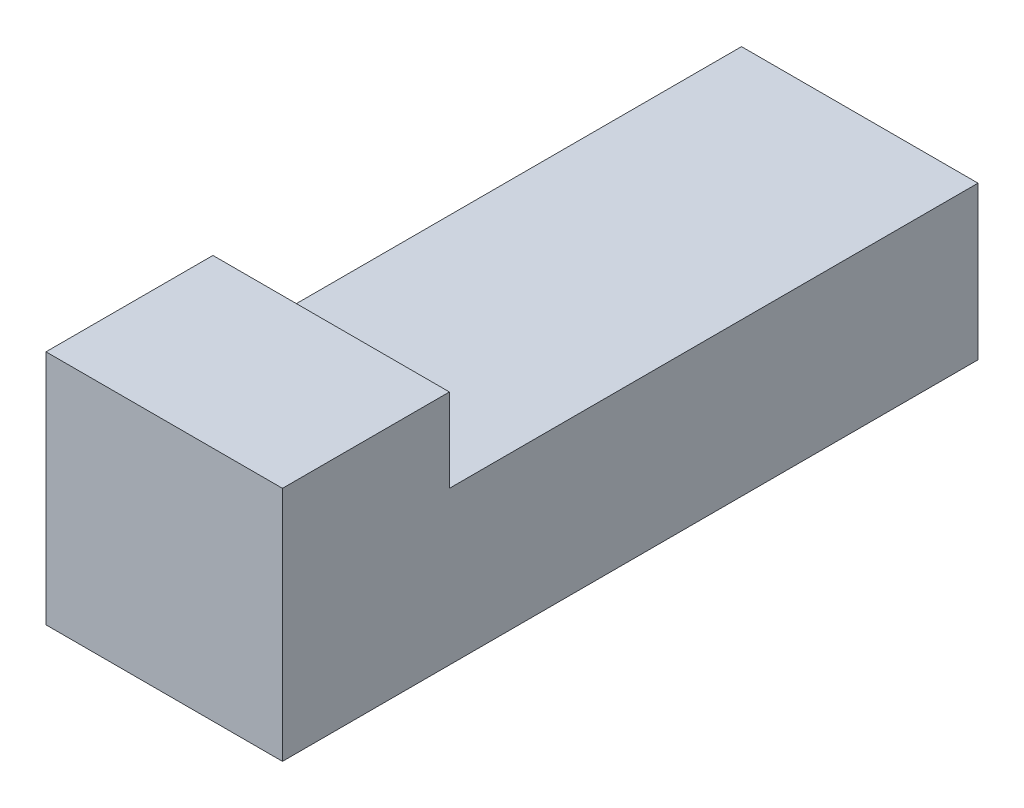
ISO-10303-21;
HEADER;
FILE_DESCRIPTION(('STEP AP214'),'2;1');
FILE_NAME('part.step','',(''),(''),'','','');
FILE_SCHEMA(('AUTOMOTIVE_DESIGN { 1 0 10303 214 1 1 1 1 }'));
ENDSEC;
DATA;
#1=APPLICATION_CONTEXT('core data for automotive mechanical design processes');
#2=APPLICATION_PROTOCOL_DEFINITION('international standard','automotive_design',2000,#1);
#3=PRODUCT_CONTEXT('',#1,'mechanical');
#4=PRODUCT('Part','Part','',(#3));
#5=PRODUCT_RELATED_PRODUCT_CATEGORY('part','',(#4));
#6=PRODUCT_DEFINITION_FORMATION('','',#4);
#7=PRODUCT_DEFINITION_CONTEXT('part definition',#1,'design');
#8=PRODUCT_DEFINITION('design','',#6,#7);
#9=PRODUCT_DEFINITION_SHAPE('','',#8);
#10=(LENGTH_UNIT() NAMED_UNIT(*) SI_UNIT(.MILLI.,.METRE.));
#11=(NAMED_UNIT(*) PLANE_ANGLE_UNIT() SI_UNIT($,.RADIAN.));
#12=(NAMED_UNIT(*) SI_UNIT($,.STERADIAN.) SOLID_ANGLE_UNIT());
#13=UNCERTAINTY_MEASURE_WITH_UNIT(LENGTH_MEASURE(1.E-05),#10,'distance_accuracy_value','');
#14=(GEOMETRIC_REPRESENTATION_CONTEXT(3) GLOBAL_UNCERTAINTY_ASSIGNED_CONTEXT((#13)) GLOBAL_UNIT_ASSIGNED_CONTEXT((#10,
#11,#12)) REPRESENTATION_CONTEXT('',''));
#15=CARTESIAN_POINT('',(0.,0.,0.));
#16=DIRECTION('',(0.,0.,1.));
#17=DIRECTION('',(1.,0.,0.));
#18=AXIS2_PLACEMENT_3D('',#15,#16,#17);
#19=CARTESIAN_POINT('',(-34.2810417125712,1.38297930543054,12.7));
#20=DIRECTION('',(1.,0.,0.));
#21=DIRECTION('',(0.,0.,-1.));
#22=AXIS2_PLACEMENT_3D('',#19,#20,#21);
#23=PLANE('',#22);
#24=DIRECTION('',(0.,-1.,0.));
#25=VECTOR('',#24,1.);
#26=CARTESIAN_POINT('',(-34.2810417125712,1.38297930543054,9.652));
#27=LINE('',#26,#25);
#28=CARTESIAN_POINT('',(-34.2810417125712,1.38297930543054,9.652));
#29=VERTEX_POINT('',#28);
#30=CARTESIAN_POINT('',(-34.2810417125712,-0.141020694569455,9.652));
#31=VERTEX_POINT('',#30);
#32=EDGE_CURVE('E102',#29,#31,#27,.T.);
#33=ORIENTED_EDGE('',*,*,#32,.T.);
#34=DIRECTION('',(0.,0.,1.));
#35=VECTOR('',#34,1.);
#36=CARTESIAN_POINT('',(-34.2810417125712,-0.141020694569455,-3.048));
#37=LINE('',#36,#35);
#38=CARTESIAN_POINT('',(-34.2810417125712,-0.141020694569455,0.));
#39=VERTEX_POINT('',#38);
#40=EDGE_CURVE('E91',#39,#31,#37,.T.);
#41=ORIENTED_EDGE('',*,*,#40,.F.);
#42=DIRECTION('',(0.,-1.,0.));
#43=VECTOR('',#42,1.);
#44=CARTESIAN_POINT('',(-34.2810417125712,1.38297930543054,0.));
#45=LINE('',#44,#43);
#46=CARTESIAN_POINT('',(-34.2810417125712,-2.93502069456945,0.));
#47=VERTEX_POINT('',#46);
#48=EDGE_CURVE('E114',#39,#47,#45,.T.);
#49=ORIENTED_EDGE('',*,*,#48,.T.);
#50=DIRECTION('',(0.,0.,-1.));
#51=VECTOR('',#50,1.);
#52=CARTESIAN_POINT('',(-34.2810417125712,-2.93502069456945,12.7));
#53=LINE('',#52,#51);
#54=CARTESIAN_POINT('',(-34.2810417125712,-2.93502069456945,12.7));
#55=VERTEX_POINT('',#54);
#56=EDGE_CURVE('E40',#55,#47,#53,.T.);
#57=ORIENTED_EDGE('',*,*,#56,.F.);
#58=DIRECTION('',(0.,-1.,0.));
#59=VECTOR('',#58,1.);
#60=CARTESIAN_POINT('',(-34.2810417125712,1.38297930543054,12.7));
#61=LINE('',#60,#59);
#62=CARTESIAN_POINT('',(-34.2810417125712,1.38297930543054,12.7));
#63=VERTEX_POINT('',#62);
#64=EDGE_CURVE('E116',#63,#55,#61,.T.);
#65=ORIENTED_EDGE('',*,*,#64,.F.);
#66=DIRECTION('',(0.,0.,-1.));
#67=VECTOR('',#66,1.);
#68=CARTESIAN_POINT('',(-34.2810417125712,1.38297930543054,12.7));
#69=LINE('',#68,#67);
#70=EDGE_CURVE('E109',#63,#29,#69,.T.);
#71=ORIENTED_EDGE('',*,*,#70,.T.);
#72=EDGE_LOOP('',(#33,#41,#49,#57,#65,#71));
#73=FACE_BOUND('',#72,.T.);
#74=ADVANCED_FACE('F33',(#73),#23,.F.);
#75=CARTESIAN_POINT('',(-34.2810417125712,-2.93502069456945,12.7));
#76=DIRECTION('',(0.,1.,0.));
#77=DIRECTION('',(0.,0.,1.));
#78=AXIS2_PLACEMENT_3D('',#75,#76,#77);
#79=PLANE('',#78);
#80=DIRECTION('',(1.,0.,0.));
#81=VECTOR('',#80,1.);
#82=CARTESIAN_POINT('',(-34.2810417125712,-2.93502069456945,0.));
#83=LINE('',#82,#81);
#84=CARTESIAN_POINT('',(-29.9630417125712,-2.93502069456945,0.));
#85=VERTEX_POINT('',#84);
#86=EDGE_CURVE('E71',#47,#85,#83,.T.);
#87=ORIENTED_EDGE('',*,*,#86,.T.);
#88=DIRECTION('',(0.,0.,-1.));
#89=VECTOR('',#88,1.);
#90=CARTESIAN_POINT('',(-29.9630417125712,-2.93502069456945,12.7));
#91=LINE('',#90,#89);
#92=CARTESIAN_POINT('',(-29.9630417125712,-2.93502069456945,12.7));
#93=VERTEX_POINT('',#92);
#94=EDGE_CURVE('E131',#93,#85,#91,.T.);
#95=ORIENTED_EDGE('',*,*,#94,.F.);
#96=DIRECTION('',(1.,0.,0.));
#97=VECTOR('',#96,1.);
#98=CARTESIAN_POINT('',(-34.2810417125712,-2.93502069456945,12.7));
#99=LINE('',#98,#97);
#100=EDGE_CURVE('E76',#55,#93,#99,.T.);
#101=ORIENTED_EDGE('',*,*,#100,.F.);
#102=ORIENTED_EDGE('',*,*,#56,.T.);
#103=EDGE_LOOP('',(#87,#95,#101,#102));
#104=FACE_BOUND('',#103,.T.);
#105=ADVANCED_FACE('F133',(#104),#79,.F.);
#106=CARTESIAN_POINT('',(-29.9630417125712,1.38297930543054,12.7));
#107=DIRECTION('',(-1.,0.,0.));
#108=DIRECTION('',(0.,0.,1.));
#109=AXIS2_PLACEMENT_3D('',#106,#107,#108);
#110=PLANE('',#109);
#111=DIRECTION('',(0.,1.,0.));
#112=VECTOR('',#111,1.);
#113=CARTESIAN_POINT('',(-29.9630417125712,1.38297930543054,0.));
#114=LINE('',#113,#112);
#115=CARTESIAN_POINT('',(-29.9630417125712,-0.141020694569455,0.));
#116=VERTEX_POINT('',#115);
#117=EDGE_CURVE('E118',#85,#116,#114,.T.);
#118=ORIENTED_EDGE('',*,*,#117,.T.);
#119=DIRECTION('',(0.,0.,1.));
#120=VECTOR('',#119,1.);
#121=CARTESIAN_POINT('',(-29.9630417125712,-0.141020694569455,-3.048));
#122=LINE('',#121,#120);
#123=CARTESIAN_POINT('',(-29.9630417125712,-0.141020694569455,9.652));
#124=VERTEX_POINT('',#123);
#125=EDGE_CURVE('E47',#116,#124,#122,.T.);
#126=ORIENTED_EDGE('',*,*,#125,.T.);
#127=DIRECTION('',(0.,1.,0.));
#128=VECTOR('',#127,1.);
#129=CARTESIAN_POINT('',(-29.9630417125712,1.38297930543054,9.652));
#130=LINE('',#129,#128);
#131=CARTESIAN_POINT('',(-29.9630417125712,1.38297930543054,9.652));
#132=VERTEX_POINT('',#131);
#133=EDGE_CURVE('E105',#124,#132,#130,.T.);
#134=ORIENTED_EDGE('',*,*,#133,.T.);
#135=DIRECTION('',(0.,0.,-1.));
#136=VECTOR('',#135,1.);
#137=CARTESIAN_POINT('',(-29.9630417125712,1.38297930543054,12.7));
#138=LINE('',#137,#136);
#139=CARTESIAN_POINT('',(-29.9630417125712,1.38297930543054,12.7));
#140=VERTEX_POINT('',#139);
#141=EDGE_CURVE('E128',#140,#132,#138,.T.);
#142=ORIENTED_EDGE('',*,*,#141,.F.);
#143=DIRECTION('',(0.,1.,0.));
#144=VECTOR('',#143,1.);
#145=CARTESIAN_POINT('',(-29.9630417125712,1.38297930543054,12.7));
#146=LINE('',#145,#144);
#147=EDGE_CURVE('E120',#93,#140,#146,.T.);
#148=ORIENTED_EDGE('',*,*,#147,.F.);
#149=ORIENTED_EDGE('',*,*,#94,.T.);
#150=EDGE_LOOP('',(#118,#126,#134,#142,#148,#149));
#151=FACE_BOUND('',#150,.T.);
#152=ADVANCED_FACE('F138',(#151),#110,.F.);
#153=CARTESIAN_POINT('',(-34.2810417125712,1.38297930543054,12.7));
#154=DIRECTION('',(0.,-1.,0.));
#155=DIRECTION('',(0.,0.,-1.));
#156=AXIS2_PLACEMENT_3D('',#153,#154,#155);
#157=PLANE('',#156);
#158=ORIENTED_EDGE('',*,*,#141,.T.);
#159=DIRECTION('',(-1.,0.,0.));
#160=VECTOR('',#159,1.);
#161=CARTESIAN_POINT('',(-34.2810417125712,1.38297930543054,9.652));
#162=LINE('',#161,#160);
#163=EDGE_CURVE('E98',#132,#29,#162,.T.);
#164=ORIENTED_EDGE('',*,*,#163,.T.);
#165=ORIENTED_EDGE('',*,*,#70,.F.);
#166=DIRECTION('',(-1.,0.,0.));
#167=VECTOR('',#166,1.);
#168=CARTESIAN_POINT('',(-34.2810417125712,1.38297930543054,12.7));
#169=LINE('',#168,#167);
#170=EDGE_CURVE('E55',#140,#63,#169,.T.);
#171=ORIENTED_EDGE('',*,*,#170,.F.);
#172=EDGE_LOOP('',(#158,#164,#165,#171));
#173=FACE_BOUND('',#172,.T.);
#174=ADVANCED_FACE('F143',(#173),#157,.F.);
#175=CARTESIAN_POINT('',(0.,0.,12.7));
#176=DIRECTION('',(0.,0.,1.));
#177=DIRECTION('',(1.,0.,0.));
#178=AXIS2_PLACEMENT_3D('',#175,#176,#177);
#179=PLANE('',#178);
#180=ORIENTED_EDGE('',*,*,#64,.T.);
#181=ORIENTED_EDGE('',*,*,#100,.T.);
#182=ORIENTED_EDGE('',*,*,#147,.T.);
#183=ORIENTED_EDGE('',*,*,#170,.T.);
#184=EDGE_LOOP('',(#180,#181,#182,#183));
#185=FACE_BOUND('',#184,.T.);
#186=ADVANCED_FACE('F141',(#185),#179,.T.);
#187=CARTESIAN_POINT('',(0.,0.,0.));
#188=DIRECTION('',(0.,0.,1.));
#189=DIRECTION('',(1.,0.,0.));
#190=AXIS2_PLACEMENT_3D('',#187,#188,#189);
#191=PLANE('',#190);
#192=ORIENTED_EDGE('',*,*,#48,.F.);
#193=DIRECTION('',(1.,0.,0.));
#194=VECTOR('',#193,1.);
#195=CARTESIAN_POINT('',(0.,-0.141020694569455,0.));
#196=LINE('',#195,#194);
#197=EDGE_CURVE('E11',#39,#116,#196,.T.);
#198=ORIENTED_EDGE('',*,*,#197,.T.);
#199=ORIENTED_EDGE('',*,*,#117,.F.);
#200=ORIENTED_EDGE('',*,*,#86,.F.);
#201=EDGE_LOOP('',(#192,#198,#199,#200));
#202=FACE_BOUND('',#201,.T.);
#203=ADVANCED_FACE('F136',(#202),#191,.F.);
#204=CARTESIAN_POINT('',(-34.2810417125712,-0.141020694569455,-3.048));
#205=DIRECTION('',(0.,-1.,0.));
#206=DIRECTION('',(0.,0.,-1.));
#207=AXIS2_PLACEMENT_3D('',#204,#205,#206);
#208=PLANE('',#207);
#209=ORIENTED_EDGE('',*,*,#40,.T.);
#210=DIRECTION('',(1.,0.,0.));
#211=VECTOR('',#210,1.);
#212=CARTESIAN_POINT('',(-34.2810417125712,-0.141020694569455,9.652));
#213=LINE('',#212,#211);
#214=EDGE_CURVE('E94',#31,#124,#213,.T.);
#215=ORIENTED_EDGE('',*,*,#214,.T.);
#216=ORIENTED_EDGE('',*,*,#125,.F.);
#217=ORIENTED_EDGE('',*,*,#197,.F.);
#218=EDGE_LOOP('',(#209,#215,#216,#217));
#219=FACE_BOUND('',#218,.T.);
#220=ADVANCED_FACE('F93',(#219),#208,.F.);
#221=CARTESIAN_POINT('',(0.,0.,9.652));
#222=DIRECTION('',(0.,0.,1.));
#223=DIRECTION('',(1.,0.,0.));
#224=AXIS2_PLACEMENT_3D('',#221,#222,#223);
#225=PLANE('',#224);
#226=ORIENTED_EDGE('',*,*,#32,.F.);
#227=ORIENTED_EDGE('',*,*,#163,.F.);
#228=ORIENTED_EDGE('',*,*,#133,.F.);
#229=ORIENTED_EDGE('',*,*,#214,.F.);
#230=EDGE_LOOP('',(#226,#227,#228,#229));
#231=FACE_BOUND('',#230,.T.);
#232=ADVANCED_FACE('F101',(#231),#225,.F.);
#233=CLOSED_SHELL('',(#74,#105,#152,#174,#186,#203,#220,#232));
#234=MANIFOLD_SOLID_BREP('B2',#233);
#235=ADVANCED_BREP_SHAPE_REPRESENTATION('',(#18,#234),#14);
#236=SHAPE_DEFINITION_REPRESENTATION(#9,#235);
ENDSEC;
END-ISO-10303-21;
